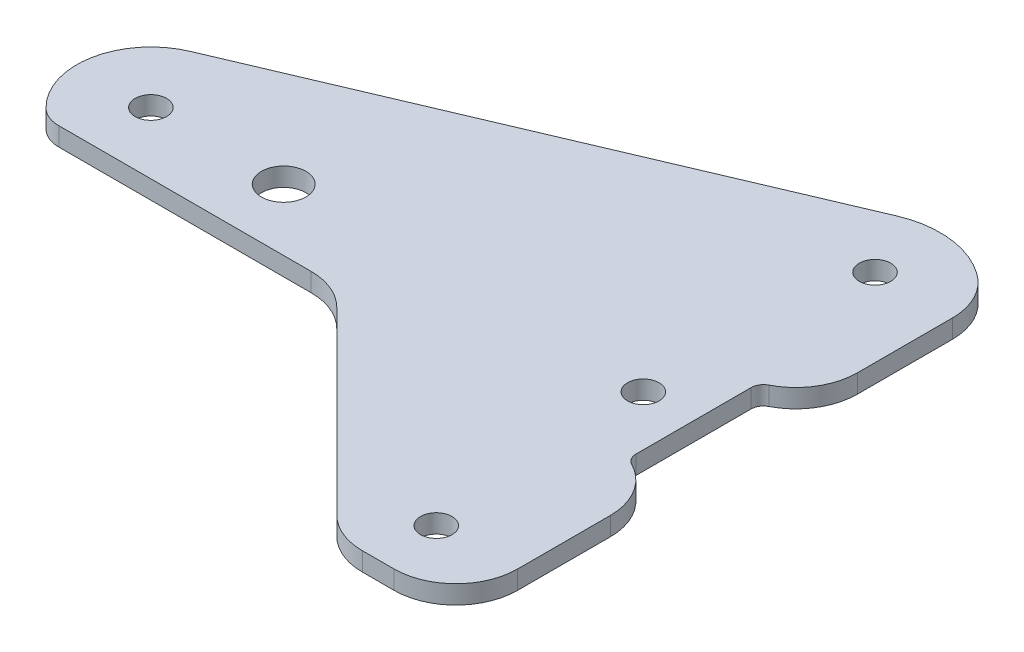
ISO-10303-21;
HEADER;
FILE_DESCRIPTION(('STEP AP214'),'2;1');
FILE_NAME('part.step','',(''),(''),'','','');
FILE_SCHEMA(('AUTOMOTIVE_DESIGN { 1 0 10303 214 1 1 1 1 }'));
ENDSEC;
DATA;
#1=APPLICATION_CONTEXT('core data for automotive mechanical design processes');
#2=APPLICATION_PROTOCOL_DEFINITION('international standard','automotive_design',2000,#1);
#3=PRODUCT_CONTEXT('',#1,'mechanical');
#4=PRODUCT('Part','Part','',(#3));
#5=PRODUCT_RELATED_PRODUCT_CATEGORY('part','',(#4));
#6=PRODUCT_DEFINITION_FORMATION('','',#4);
#7=PRODUCT_DEFINITION_CONTEXT('part definition',#1,'design');
#8=PRODUCT_DEFINITION('design','',#6,#7);
#9=PRODUCT_DEFINITION_SHAPE('','',#8);
#10=(LENGTH_UNIT() NAMED_UNIT(*) SI_UNIT(.MILLI.,.METRE.));
#11=(NAMED_UNIT(*) PLANE_ANGLE_UNIT() SI_UNIT($,.RADIAN.));
#12=(NAMED_UNIT(*) SI_UNIT($,.STERADIAN.) SOLID_ANGLE_UNIT());
#13=UNCERTAINTY_MEASURE_WITH_UNIT(LENGTH_MEASURE(1.E-05),#10,'distance_accuracy_value','');
#14=(GEOMETRIC_REPRESENTATION_CONTEXT(3) GLOBAL_UNCERTAINTY_ASSIGNED_CONTEXT((#13)) GLOBAL_UNIT_ASSIGNED_CONTEXT((#10,
#11,#12)) REPRESENTATION_CONTEXT('',''));
#15=CARTESIAN_POINT('',(0.,0.,0.));
#16=DIRECTION('',(0.,0.,1.));
#17=DIRECTION('',(1.,0.,0.));
#18=AXIS2_PLACEMENT_3D('',#15,#16,#17);
#19=CARTESIAN_POINT('',(243.548253692,70.6652182043,21.06693323164));
#20=DIRECTION('',(0.578405924452189,0.,-0.815749095346485));
#21=DIRECTION('',(-0.815749095346485,0.,-0.578405924452189));
#22=AXIS2_PLACEMENT_3D('',#19,#20,#21);
#23=PLANE('',#22);
#24=DIRECTION('',(0.,1.,0.));
#25=VECTOR('',#24,1.);
#26=CARTESIAN_POINT('',(218.489516869227,70.6652182043,3.29906573380305));
#27=LINE('',#26,#25);
#28=CARTESIAN_POINT('',(218.48951686925,70.6652182043,3.29906573382962));
#29=VERTEX_POINT('',#28);
#30=CARTESIAN_POINT('',(218.489516869488,67.6652182043,3.29906573399572));
#31=VERTEX_POINT('',#30);
#32=EDGE_CURVE('E302',#29,#31,#27,.F.);
#33=ORIENTED_EDGE('',*,*,#32,.F.);
#34=DIRECTION('',(-0.815749095346485,0.,-0.578405924452189));
#35=VECTOR('',#34,1.);
#36=CARTESIAN_POINT('',(243.548253692,70.6652182043,21.06693323164));
#37=LINE('',#36,#35);
#38=CARTESIAN_POINT('',(218.548253692011,70.6652182043,3.34071300805364));
#39=VERTEX_POINT('',#38);
#40=EDGE_CURVE('E197',#29,#39,#37,.F.);
#41=ORIENTED_EDGE('',*,*,#40,.T.);
#42=DIRECTION('',(0.,-1.,0.));
#43=VECTOR('',#42,1.);
#44=CARTESIAN_POINT('',(218.548253692006,70.6652182043,3.3407130080441));
#45=LINE('',#44,#43);
#46=CARTESIAN_POINT('',(218.54825369217,67.6652182043,3.3407130081649));
#47=VERTEX_POINT('',#46);
#48=EDGE_CURVE('E301',#47,#39,#45,.F.);
#49=ORIENTED_EDGE('',*,*,#48,.F.);
#50=DIRECTION('',(0.815749095324096,0.,0.578405924483765));
#51=VECTOR('',#50,1.);
#52=CARTESIAN_POINT('',(218.48951686922,67.6652182043,3.2990657338129));
#53=LINE('',#52,#51);
#54=EDGE_CURVE('E182',#31,#47,#53,.T.);
#55=ORIENTED_EDGE('',*,*,#54,.F.);
#56=EDGE_LOOP('',(#33,#41,#49,#55));
#57=FACE_BOUND('',#56,.T.);
#58=ADVANCED_FACE('F37',(#57),#23,.T.);
#59=CARTESIAN_POINT('',(123.5086322231,67.6652182043,51.87705587159));
#60=DIRECTION('',(0.,-1.,0.));
#61=DIRECTION('',(0.,0.,-1.));
#62=AXIS2_PLACEMENT_3D('',#59,#60,#61);
#63=PLANE('',#62);
#64=CARTESIAN_POINT('',(208.1076117087,67.6652182043,46.87705587159));
#65=DIRECTION('',(0.,1.,0.));
#66=DIRECTION('',(0.,0.,1.));
#67=AXIS2_PLACEMENT_3D('',#64,#65,#66);
#68=CIRCLE('',#67,2.54999999999999);
#69=CARTESIAN_POINT('',(208.1076117087,67.6652182043,49.42705587159));
#70=VERTEX_POINT('',#69);
#71=EDGE_CURVE('E220',#70,#70,#68,.T.);
#72=ORIENTED_EDGE('',*,*,#71,.T.);
#73=EDGE_LOOP('',(#72));
#74=FACE_BOUND('',#73,.T.);
#75=CARTESIAN_POINT('',(210.1,67.6652182043,82.37705587159));
#76=DIRECTION('',(0.,-1.,0.));
#77=DIRECTION('',(0.,0.,-1.));
#78=AXIS2_PLACEMENT_3D('',#75,#76,#77);
#79=CIRCLE('',#78,2.55);
#80=CARTESIAN_POINT('',(210.1,67.6652182043,79.82705587159));
#81=VERTEX_POINT('',#80);
#82=EDGE_CURVE('E274',#81,#81,#79,.F.);
#83=ORIENTED_EDGE('',*,*,#82,.T.);
#84=EDGE_LOOP('',(#83));
#85=FACE_BOUND('',#84,.T.);
#86=CARTESIAN_POINT('',(210.1,67.6652182043,11.37705587159));
#87=DIRECTION('',(0.,-1.,0.));
#88=DIRECTION('',(0.,0.,-1.));
#89=AXIS2_PLACEMENT_3D('',#86,#87,#88);
#90=CIRCLE('',#89,2.55);
#91=CARTESIAN_POINT('',(210.1,67.6652182043,8.82705587159));
#92=VERTEX_POINT('',#91);
#93=EDGE_CURVE('E277',#92,#92,#90,.F.);
#94=ORIENTED_EDGE('',*,*,#93,.T.);
#95=EDGE_LOOP('',(#94));
#96=FACE_BOUND('',#95,.T.);
#97=CARTESIAN_POINT('',(164.3506005389,67.6652182043,66.87705587159));
#98=DIRECTION('',(0.,1.,0.));
#99=DIRECTION('',(0.,0.,1.));
#100=AXIS2_PLACEMENT_3D('',#97,#98,#99);
#101=CIRCLE('',#100,10.);
#102=CARTESIAN_POINT('',(171.421668350768,67.6652182043,59.8059880597423));
#103=VERTEX_POINT('',#102);
#104=CARTESIAN_POINT('',(164.3506005389,67.6652182043,56.87705587159));
#105=VERTEX_POINT('',#104);
#106=EDGE_CURVE('E176',#103,#105,#101,.T.);
#107=ORIENTED_EDGE('',*,*,#106,.T.);
#108=DIRECTION('',(-1.,0.,0.));
#109=VECTOR('',#108,1.);
#110=CARTESIAN_POINT('',(186.,67.6652182043,56.87705587159));
#111=LINE('',#110,#109);
#112=CARTESIAN_POINT('',(123.5086322231,67.6652182043,56.87705587159));
#113=VERTEX_POINT('',#112);
#114=EDGE_CURVE('E170',#105,#113,#111,.T.);
#115=ORIENTED_EDGE('',*,*,#114,.T.);
#116=CARTESIAN_POINT('',(123.5086322231,67.6652182043,51.87705587159));
#117=DIRECTION('',(0.,-1.,0.));
#118=DIRECTION('',(0.,0.,-1.));
#119=AXIS2_PLACEMENT_3D('',#116,#117,#118);
#120=CIRCLE('',#119,5.);
#121=CARTESIAN_POINT('',(120.009361161997,67.6652182043,55.4484844430008));
#122=VERTEX_POINT('',#121);
#123=EDGE_CURVE('E40',#122,#113,#120,.F.);
#124=ORIENTED_EDGE('',*,*,#123,.F.);
#125=CARTESIAN_POINT('',(128.4076117087,67.6652182043,46.87705587159));
#126=DIRECTION('',(0.,1.,0.));
#127=DIRECTION('',(0.,0.,1.));
#128=AXIS2_PLACEMENT_3D('',#125,#126,#127);
#129=CIRCLE('',#128,12.);
#130=CARTESIAN_POINT('',(123.713460139609,67.6652182043,35.8332820126853));
#131=VERTEX_POINT('',#130);
#132=EDGE_CURVE('E165',#131,#122,#129,.T.);
#133=ORIENTED_EDGE('',*,*,#132,.F.);
#134=DIRECTION('',(-0.920314488241643,0.,0.391179297423218));
#135=VECTOR('',#134,1.);
#136=CARTESIAN_POINT('',(203.9457385411,67.6652182043,1.730584840413));
#137=LINE('',#136,#135);
#138=CARTESIAN_POINT('',(203.945738541126,67.6652182043,1.73058484041418));
#139=VERTEX_POINT('',#138);
#140=EDGE_CURVE('E221',#139,#131,#137,.T.);
#141=ORIENTED_EDGE('',*,*,#140,.F.);
#142=CARTESIAN_POINT('',(209.8134280025,67.6652182043,15.53530216404));
#143=DIRECTION('',(0.,1.,0.));
#144=DIRECTION('',(0.,0.,1.));
#145=AXIS2_PLACEMENT_3D('',#142,#143,#144);
#146=CIRCLE('',#145,15.);
#147=EDGE_CURVE('E303',#31,#139,#146,.T.);
#148=ORIENTED_EDGE('',*,*,#147,.F.);
#149=ORIENTED_EDGE('',*,*,#54,.T.);
#150=CARTESIAN_POINT('',(212.7641944475,67.6652182043,11.49820396152));
#151=DIRECTION('',(0.,-1.,0.));
#152=DIRECTION('',(0.,0.,-1.));
#153=AXIS2_PLACEMENT_3D('',#150,#151,#152);
#154=CIRCLE('',#153,10.);
#155=CARTESIAN_POINT('',(222.7641944475,67.6652182043,11.49820396152));
#156=VERTEX_POINT('',#155);
#157=EDGE_CURVE('E298',#156,#47,#154,.F.);
#158=ORIENTED_EDGE('',*,*,#157,.F.);
#159=DIRECTION('',(0.,0.,-1.));
#160=VECTOR('',#159,1.);
#161=CARTESIAN_POINT('',(222.7641944475,67.6652182043,46.01057575408));
#162=LINE('',#161,#160);
#163=CARTESIAN_POINT('',(222.7641944475,67.6652182043,26.87705587159));
#164=VERTEX_POINT('',#163);
#165=EDGE_CURVE('E214',#164,#156,#162,.T.);
#166=ORIENTED_EDGE('',*,*,#165,.F.);
#167=CARTESIAN_POINT('',(212.7641944475,67.6652182043,26.87705587159));
#168=DIRECTION('',(0.,1.,0.));
#169=DIRECTION('',(0.,0.,1.));
#170=AXIS2_PLACEMENT_3D('',#167,#168,#169);
#171=CIRCLE('',#170,10.);
#172=CARTESIAN_POINT('',(217.323870368322,67.6652182043,35.7770196634822));
#173=VERTEX_POINT('',#172);
#174=EDGE_CURVE('E217',#173,#164,#171,.T.);
#175=ORIENTED_EDGE('',*,*,#174,.F.);
#176=CARTESIAN_POINT('',(218.2358055525,67.6652182043,37.55701242185));
#177=DIRECTION('',(0.,1.,0.));
#178=DIRECTION('',(0.,0.,1.));
#179=AXIS2_PLACEMENT_3D('',#176,#177,#178);
#180=CIRCLE('',#179,2.);
#181=CARTESIAN_POINT('',(216.2358055525,67.6652182043,37.55701242185));
#182=VERTEX_POINT('',#181);
#183=EDGE_CURVE('E213',#173,#182,#180,.T.);
#184=ORIENTED_EDGE('',*,*,#183,.T.);
#185=DIRECTION('',(0.,0.,-1.));
#186=VECTOR('',#185,1.);
#187=CARTESIAN_POINT('',(216.2358055525,67.6652182043,57.49900083147));
#188=LINE('',#187,#186);
#189=CARTESIAN_POINT('',(216.2358055525,67.6652182043,56.19709932133));
#190=VERTEX_POINT('',#189);
#191=EDGE_CURVE('E210',#190,#182,#188,.T.);
#192=ORIENTED_EDGE('',*,*,#191,.F.);
#193=CARTESIAN_POINT('',(218.2358055525,67.6652182043,56.19709932133));
#194=DIRECTION('',(0.,-1.,0.));
#195=DIRECTION('',(0.,0.,-1.));
#196=AXIS2_PLACEMENT_3D('',#193,#194,#195);
#197=CIRCLE('',#196,2.);
#198=CARTESIAN_POINT('',(217.323870368324,67.6652182043,57.9770920796941));
#199=VERTEX_POINT('',#198);
#200=EDGE_CURVE('E289',#190,#199,#197,.F.);
#201=ORIENTED_EDGE('',*,*,#200,.T.);
#202=CARTESIAN_POINT('',(212.7641944475,67.6652182043,66.87705587159));
#203=DIRECTION('',(0.,-1.,0.));
#204=DIRECTION('',(0.,0.,-1.));
#205=AXIS2_PLACEMENT_3D('',#202,#203,#204);
#206=CIRCLE('',#205,9.99999999999999);
#207=CARTESIAN_POINT('',(222.7641944475,67.6652182043,66.87705587159));
#208=VERTEX_POINT('',#207);
#209=EDGE_CURVE('E287',#208,#199,#206,.F.);
#210=ORIENTED_EDGE('',*,*,#209,.F.);
#211=DIRECTION('',(0.,0.,-1.));
#212=VECTOR('',#211,1.);
#213=CARTESIAN_POINT('',(222.7641944475,67.6652182043,46.01057575408));
#214=LINE('',#213,#212);
#215=CARTESIAN_POINT('',(222.7641944475,67.6652182043,81.87705587159));
#216=VERTEX_POINT('',#215);
#217=EDGE_CURVE('E206',#216,#208,#214,.T.);
#218=ORIENTED_EDGE('',*,*,#217,.F.);
#219=CARTESIAN_POINT('',(212.7641944475,67.6652182043,81.87705587159));
#220=DIRECTION('',(0.,1.,0.));
#221=DIRECTION('',(0.,0.,1.));
#222=AXIS2_PLACEMENT_3D('',#219,#220,#221);
#223=CIRCLE('',#222,9.99999999999999);
#224=CARTESIAN_POINT('',(212.7641944475,67.6652182043,91.87705587159));
#225=VERTEX_POINT('',#224);
#226=EDGE_CURVE('E205',#225,#216,#223,.T.);
#227=ORIENTED_EDGE('',*,*,#226,.F.);
#228=DIRECTION('',(1.,0.,0.));
#229=VECTOR('',#228,1.);
#230=CARTESIAN_POINT('',(167.5857864376,67.6652182043,91.87705587159));
#231=LINE('',#230,#229);
#232=CARTESIAN_POINT('',(207.6348717864,67.6652182043,91.87705587159));
#233=VERTEX_POINT('',#232);
#234=EDGE_CURVE('E202',#233,#225,#231,.T.);
#235=ORIENTED_EDGE('',*,*,#234,.F.);
#236=CARTESIAN_POINT('',(207.6348717864,67.6652182043,81.87705587159));
#237=DIRECTION('',(0.,-1.,0.));
#238=DIRECTION('',(0.,0.,-1.));
#239=AXIS2_PLACEMENT_3D('',#236,#237,#238);
#240=CIRCLE('',#239,10.);
#241=CARTESIAN_POINT('',(200.563803974493,67.6652182043,88.9481236834825));
#242=VERTEX_POINT('',#241);
#243=EDGE_CURVE('E282',#242,#233,#240,.F.);
#244=ORIENTED_EDGE('',*,*,#243,.F.);
#245=DIRECTION('',(0.707106781186548,0.,0.707106781186548));
#246=VECTOR('',#245,1.);
#247=CARTESIAN_POINT('',(168.4927361626,67.6652182043,56.87705587159));
#248=LINE('',#247,#246);
#249=EDGE_CURVE('E198',#103,#242,#248,.T.);
#250=ORIENTED_EDGE('',*,*,#249,.F.);
#251=EDGE_LOOP('',(#107,#115,#124,#133,#141,#148,#149,#158,#166,#175,#184,#192,#201,#210,#218,
#227,#235,#244,#250));
#252=FACE_BOUND('',#251,.T.);
#253=CARTESIAN_POINT('',(149.9,67.6652182043,46.87705587159));
#254=DIRECTION('',(0.,-1.,0.));
#255=DIRECTION('',(0.,0.,-1.));
#256=AXIS2_PLACEMENT_3D('',#253,#254,#255);
#257=CIRCLE('',#256,3.59999999999999);
#258=CARTESIAN_POINT('',(149.9,67.6652182043,43.27705587159));
#259=VERTEX_POINT('',#258);
#260=EDGE_CURVE('E268',#259,#259,#257,.F.);
#261=ORIENTED_EDGE('',*,*,#260,.T.);
#262=EDGE_LOOP('',(#261));
#263=FACE_BOUND('',#262,.T.);
#264=CARTESIAN_POINT('',(128.4076117087,67.6652182043,46.87705587159));
#265=DIRECTION('',(0.,1.,0.));
#266=DIRECTION('',(0.,0.,1.));
#267=AXIS2_PLACEMENT_3D('',#264,#265,#266);
#268=CIRCLE('',#267,2.55);
#269=CARTESIAN_POINT('',(128.4076117087,67.6652182043,49.42705587159));
#270=VERTEX_POINT('',#269);
#271=EDGE_CURVE('E271',#270,#270,#268,.T.);
#272=ORIENTED_EDGE('',*,*,#271,.T.);
#273=EDGE_LOOP('',(#272));
#274=FACE_BOUND('',#273,.T.);
#275=ADVANCED_FACE('F172',(#74,#85,#96,#252,#263,#274),#63,.T.);
#276=CARTESIAN_POINT('',(186.,67.6652182043,56.87705587159));
#277=DIRECTION('',(0.,0.,-1.));
#278=DIRECTION('',(-1.,0.,0.));
#279=AXIS2_PLACEMENT_3D('',#276,#277,#278);
#280=PLANE('',#279);
#281=DIRECTION('',(1.,0.,0.));
#282=VECTOR('',#281,1.);
#283=CARTESIAN_POINT('',(225.5,70.6652182043,56.87705587159));
#284=LINE('',#283,#282);
#285=CARTESIAN_POINT('',(164.3506005389,70.6652182043,56.87705587159));
#286=VERTEX_POINT('',#285);
#287=CARTESIAN_POINT('',(123.5086322231,70.6652182043,56.87705587159));
#288=VERTEX_POINT('',#287);
#289=EDGE_CURVE('E191',#286,#288,#284,.F.);
#290=ORIENTED_EDGE('',*,*,#289,.T.);
#291=DIRECTION('',(0.,-1.,0.));
#292=VECTOR('',#291,1.);
#293=CARTESIAN_POINT('',(123.5086322231,76.9302182043,56.87705587159));
#294=LINE('',#293,#292);
#295=EDGE_CURVE('E181',#113,#288,#294,.F.);
#296=ORIENTED_EDGE('',*,*,#295,.F.);
#297=ORIENTED_EDGE('',*,*,#114,.F.);
#298=DIRECTION('',(0.,1.,0.));
#299=VECTOR('',#298,1.);
#300=CARTESIAN_POINT('',(164.3506005389,67.6652182043,56.87705587159));
#301=LINE('',#300,#299);
#302=EDGE_CURVE('E281',#105,#286,#301,.T.);
#303=ORIENTED_EDGE('',*,*,#302,.T.);
#304=EDGE_LOOP('',(#290,#296,#297,#303));
#305=FACE_BOUND('',#304,.T.);
#306=ADVANCED_FACE('F190',(#305),#280,.F.);
#307=CARTESIAN_POINT('',(123.5086322231,76.9302182043,51.87705587159));
#308=DIRECTION('',(0.,-1.,0.));
#309=DIRECTION('',(0.,0.,-1.));
#310=AXIS2_PLACEMENT_3D('',#307,#308,#309);
#311=CYLINDRICAL_SURFACE('',#310,5.);
#312=DIRECTION('',(0.,1.,0.));
#313=VECTOR('',#312,1.);
#314=CARTESIAN_POINT('',(120.009361162008,70.6652182043,55.4484844430119));
#315=LINE('',#314,#313);
#316=CARTESIAN_POINT('',(120.009361161997,70.6652182043,55.4484844430008));
#317=VERTEX_POINT('',#316);
#318=EDGE_CURVE('E188',#122,#317,#315,.T.);
#319=ORIENTED_EDGE('',*,*,#318,.F.);
#320=ORIENTED_EDGE('',*,*,#123,.T.);
#321=ORIENTED_EDGE('',*,*,#295,.T.);
#322=CARTESIAN_POINT('',(123.5086322231,70.6652182043,51.87705587159));
#323=DIRECTION('',(0.,-1.,0.));
#324=DIRECTION('',(0.,0.,-1.));
#325=AXIS2_PLACEMENT_3D('',#322,#323,#324);
#326=CIRCLE('',#325,5.);
#327=EDGE_CURVE('E266',#288,#317,#326,.T.);
#328=ORIENTED_EDGE('',*,*,#327,.T.);
#329=EDGE_LOOP('',(#319,#320,#321,#328));
#330=FACE_BOUND('',#329,.T.);
#331=ADVANCED_FACE('F185',(#330),#311,.T.);
#332=CARTESIAN_POINT('',(128.4076117087,70.6652182043,46.87705587159));
#333=DIRECTION('',(0.,1.,0.));
#334=DIRECTION('',(0.,0.,1.));
#335=AXIS2_PLACEMENT_3D('',#332,#333,#334);
#336=CYLINDRICAL_SURFACE('',#335,12.);
#337=ORIENTED_EDGE('',*,*,#132,.T.);
#338=ORIENTED_EDGE('',*,*,#318,.T.);
#339=CARTESIAN_POINT('',(128.4076117087,70.6652182043,46.87705587159));
#340=DIRECTION('',(0.,1.,0.));
#341=DIRECTION('',(0.,0.,1.));
#342=AXIS2_PLACEMENT_3D('',#339,#340,#341);
#343=CIRCLE('',#342,12.);
#344=CARTESIAN_POINT('',(123.713460139609,70.6652182043,35.8332820126857));
#345=VERTEX_POINT('',#344);
#346=EDGE_CURVE('E263',#317,#345,#343,.F.);
#347=ORIENTED_EDGE('',*,*,#346,.T.);
#348=DIRECTION('',(0.,1.,0.));
#349=VECTOR('',#348,1.);
#350=CARTESIAN_POINT('',(123.7134601396,70.6652182043,35.8332820126891));
#351=LINE('',#350,#349);
#352=EDGE_CURVE('E222',#131,#345,#351,.T.);
#353=ORIENTED_EDGE('',*,*,#352,.F.);
#354=EDGE_LOOP('',(#337,#338,#347,#353));
#355=FACE_BOUND('',#354,.T.);
#356=ADVANCED_FACE('F306',(#355),#336,.T.);
#357=CARTESIAN_POINT('',(203.9457385411,70.6652182043,1.730584840413));
#358=DIRECTION('',(-0.391179297423218,0.,-0.920314488241643));
#359=DIRECTION('',(-0.920314488241643,0.,0.391179297423218));
#360=AXIS2_PLACEMENT_3D('',#357,#358,#359);
#361=PLANE('',#360);
#362=ORIENTED_EDGE('',*,*,#352,.T.);
#363=DIRECTION('',(0.920314488241638,0.,-0.391179297423229));
#364=VECTOR('',#363,1.);
#365=CARTESIAN_POINT('',(123.7134601396,70.6652182043,35.83328201269));
#366=LINE('',#365,#364);
#367=CARTESIAN_POINT('',(203.945738541126,70.6652182043,1.73058484041421));
#368=VERTEX_POINT('',#367);
#369=EDGE_CURVE('E262',#345,#368,#366,.T.);
#370=ORIENTED_EDGE('',*,*,#369,.T.);
#371=DIRECTION('',(0.,1.,0.));
#372=VECTOR('',#371,1.);
#373=CARTESIAN_POINT('',(203.945738541109,70.6652182043,1.7305848404336));
#374=LINE('',#373,#372);
#375=EDGE_CURVE('E304',#139,#368,#374,.T.);
#376=ORIENTED_EDGE('',*,*,#375,.F.);
#377=ORIENTED_EDGE('',*,*,#140,.T.);
#378=EDGE_LOOP('',(#362,#370,#376,#377));
#379=FACE_BOUND('',#378,.T.);
#380=ADVANCED_FACE('F340',(#379),#361,.T.);
#381=CARTESIAN_POINT('',(209.8134280025,70.6652182043,15.53530216404));
#382=DIRECTION('',(0.,1.,0.));
#383=DIRECTION('',(0.,0.,1.));
#384=AXIS2_PLACEMENT_3D('',#381,#382,#383);
#385=CYLINDRICAL_SURFACE('',#384,15.);
#386=CARTESIAN_POINT('',(209.8134280025,70.6652182043,15.53530216404));
#387=DIRECTION('',(0.,1.,0.));
#388=DIRECTION('',(0.,0.,1.));
#389=AXIS2_PLACEMENT_3D('',#386,#387,#388);
#390=CIRCLE('',#389,15.);
#391=EDGE_CURVE('E260',#368,#29,#390,.F.);
#392=ORIENTED_EDGE('',*,*,#391,.T.);
#393=ORIENTED_EDGE('',*,*,#32,.T.);
#394=ORIENTED_EDGE('',*,*,#147,.T.);
#395=ORIENTED_EDGE('',*,*,#375,.T.);
#396=EDGE_LOOP('',(#392,#393,#394,#395));
#397=FACE_BOUND('',#396,.T.);
#398=ADVANCED_FACE('F344',(#397),#385,.T.);
#399=CARTESIAN_POINT('',(212.7641944475,70.6652182043,11.49820396152));
#400=DIRECTION('',(0.,-1.,0.));
#401=DIRECTION('',(0.,0.,-1.));
#402=AXIS2_PLACEMENT_3D('',#399,#400,#401);
#403=CYLINDRICAL_SURFACE('',#402,10.);
#404=ORIENTED_EDGE('',*,*,#48,.T.);
#405=CARTESIAN_POINT('',(212.7641944475,70.6652182043,11.49820396152));
#406=DIRECTION('',(0.,-1.,0.));
#407=DIRECTION('',(0.,0.,-1.));
#408=AXIS2_PLACEMENT_3D('',#405,#406,#407);
#409=CIRCLE('',#408,10.);
#410=CARTESIAN_POINT('',(222.7641944475,70.6652182043,11.49820396152));
#411=VERTEX_POINT('',#410);
#412=EDGE_CURVE('E257',#39,#411,#409,.T.);
#413=ORIENTED_EDGE('',*,*,#412,.T.);
#414=DIRECTION('',(0.,1.,0.));
#415=VECTOR('',#414,1.);
#416=CARTESIAN_POINT('',(222.7641944475,69.4152182043,11.49820396152));
#417=LINE('',#416,#415);
#418=EDGE_CURVE('E218',#156,#411,#417,.T.);
#419=ORIENTED_EDGE('',*,*,#418,.F.);
#420=ORIENTED_EDGE('',*,*,#157,.T.);
#421=EDGE_LOOP('',(#404,#413,#419,#420));
#422=FACE_BOUND('',#421,.T.);
#423=ADVANCED_FACE('F350',(#422),#403,.T.);
#424=CARTESIAN_POINT('',(222.7641944475,69.4152182043,46.01057575408));
#425=DIRECTION('',(1.,0.,0.));
#426=DIRECTION('',(0.,0.,-1.));
#427=AXIS2_PLACEMENT_3D('',#424,#425,#426);
#428=PLANE('',#427);
#429=DIRECTION('',(0.,1.,0.));
#430=VECTOR('',#429,1.);
#431=CARTESIAN_POINT('',(222.7641944475,69.4152182043,26.87705587159));
#432=LINE('',#431,#430);
#433=CARTESIAN_POINT('',(222.7641944475,70.6652182043,26.87705587159));
#434=VERTEX_POINT('',#433);
#435=EDGE_CURVE('E297',#164,#434,#432,.T.);
#436=ORIENTED_EDGE('',*,*,#435,.F.);
#437=ORIENTED_EDGE('',*,*,#165,.T.);
#438=ORIENTED_EDGE('',*,*,#418,.T.);
#439=DIRECTION('',(0.,0.,-1.));
#440=VECTOR('',#439,1.);
#441=CARTESIAN_POINT('',(222.7641944475,70.6652182043,46.87705587159));
#442=LINE('',#441,#440);
#443=EDGE_CURVE('E256',#411,#434,#442,.F.);
#444=ORIENTED_EDGE('',*,*,#443,.T.);
#445=EDGE_LOOP('',(#436,#437,#438,#444));
#446=FACE_BOUND('',#445,.T.);
#447=ADVANCED_FACE('F358',(#446),#428,.T.);
#448=CARTESIAN_POINT('',(212.7641944475,69.4152182043,26.87705587159));
#449=DIRECTION('',(0.,1.,0.));
#450=DIRECTION('',(0.,0.,1.));
#451=AXIS2_PLACEMENT_3D('',#448,#449,#450);
#452=CYLINDRICAL_SURFACE('',#451,10.);
#453=ORIENTED_EDGE('',*,*,#435,.T.);
#454=CARTESIAN_POINT('',(212.7641944475,70.6652182043,26.87705587159));
#455=DIRECTION('',(0.,1.,0.));
#456=DIRECTION('',(0.,0.,1.));
#457=AXIS2_PLACEMENT_3D('',#454,#455,#456);
#458=CIRCLE('',#457,10.);
#459=CARTESIAN_POINT('',(217.32387036832,70.6652182043,35.7770196634785));
#460=VERTEX_POINT('',#459);
#461=EDGE_CURVE('E253',#434,#460,#458,.F.);
#462=ORIENTED_EDGE('',*,*,#461,.T.);
#463=DIRECTION('',(0.,1.,0.));
#464=VECTOR('',#463,1.);
#465=CARTESIAN_POINT('',(217.323870368308,64.9062182043,35.7770196634849));
#466=LINE('',#465,#464);
#467=EDGE_CURVE('E295',#460,#173,#466,.F.);
#468=ORIENTED_EDGE('',*,*,#467,.T.);
#469=ORIENTED_EDGE('',*,*,#174,.T.);
#470=EDGE_LOOP('',(#453,#462,#468,#469));
#471=FACE_BOUND('',#470,.T.);
#472=ADVANCED_FACE('F365',(#471),#452,.T.);
#473=CARTESIAN_POINT('',(218.2358055525,64.9062182043,37.55701242185));
#474=DIRECTION('',(0.,1.,0.));
#475=DIRECTION('',(0.,0.,1.));
#476=AXIS2_PLACEMENT_3D('',#473,#474,#475);
#477=CYLINDRICAL_SURFACE('',#476,2.);
#478=DIRECTION('',(0.,1.,0.));
#479=VECTOR('',#478,1.);
#480=CARTESIAN_POINT('',(216.2358055525,70.6652182043,37.55701242185));
#481=LINE('',#480,#479);
#482=CARTESIAN_POINT('',(216.2358055525,70.6652182043,37.55701242185));
#483=VERTEX_POINT('',#482);
#484=EDGE_CURVE('E212',#182,#483,#481,.T.);
#485=ORIENTED_EDGE('',*,*,#484,.F.);
#486=ORIENTED_EDGE('',*,*,#183,.F.);
#487=ORIENTED_EDGE('',*,*,#467,.F.);
#488=CARTESIAN_POINT('',(218.2358055525,70.6652182043,37.55701242185));
#489=DIRECTION('',(0.,1.,0.));
#490=DIRECTION('',(0.,0.,1.));
#491=AXIS2_PLACEMENT_3D('',#488,#489,#490);
#492=CIRCLE('',#491,2.);
#493=EDGE_CURVE('E250',#460,#483,#492,.T.);
#494=ORIENTED_EDGE('',*,*,#493,.T.);
#495=EDGE_LOOP('',(#485,#486,#487,#494));
#496=FACE_BOUND('',#495,.T.);
#497=ADVANCED_FACE('F364',(#496),#477,.F.);
#498=CARTESIAN_POINT('',(216.2358055525,70.6652182043,57.49900083147));
#499=DIRECTION('',(1.,0.,0.));
#500=DIRECTION('',(0.,0.,-1.));
#501=AXIS2_PLACEMENT_3D('',#498,#499,#500);
#502=PLANE('',#501);
#503=ORIENTED_EDGE('',*,*,#484,.T.);
#504=DIRECTION('',(0.,0.,-1.));
#505=VECTOR('',#504,1.);
#506=CARTESIAN_POINT('',(216.2358055525,70.6652182043,46.87705587159));
#507=LINE('',#506,#505);
#508=CARTESIAN_POINT('',(216.2358055525,70.6652182043,56.19709932133));
#509=VERTEX_POINT('',#508);
#510=EDGE_CURVE('E249',#483,#509,#507,.F.);
#511=ORIENTED_EDGE('',*,*,#510,.T.);
#512=DIRECTION('',(0.,-1.,0.));
#513=VECTOR('',#512,1.);
#514=CARTESIAN_POINT('',(216.2358055525,73.9242182043,56.19709932133));
#515=LINE('',#514,#513);
#516=EDGE_CURVE('E292',#509,#190,#515,.T.);
#517=ORIENTED_EDGE('',*,*,#516,.T.);
#518=ORIENTED_EDGE('',*,*,#191,.T.);
#519=EDGE_LOOP('',(#503,#511,#517,#518));
#520=FACE_BOUND('',#519,.T.);
#521=ADVANCED_FACE('F372',(#520),#502,.T.);
#522=CARTESIAN_POINT('',(218.2358055525,73.9242182043,56.19709932133));
#523=DIRECTION('',(0.,-1.,0.));
#524=DIRECTION('',(0.,0.,-1.));
#525=AXIS2_PLACEMENT_3D('',#522,#523,#524);
#526=CYLINDRICAL_SURFACE('',#525,2.);
#527=ORIENTED_EDGE('',*,*,#200,.F.);
#528=ORIENTED_EDGE('',*,*,#516,.F.);
#529=CARTESIAN_POINT('',(218.2358055525,70.6652182043,56.19709932133));
#530=DIRECTION('',(0.,-1.,0.));
#531=DIRECTION('',(0.,0.,-1.));
#532=AXIS2_PLACEMENT_3D('',#529,#530,#531);
#533=CIRCLE('',#532,2.);
#534=CARTESIAN_POINT('',(217.323870368324,70.6652182043,57.9770920796941));
#535=VERTEX_POINT('',#534);
#536=EDGE_CURVE('E246',#509,#535,#533,.F.);
#537=ORIENTED_EDGE('',*,*,#536,.T.);
#538=DIRECTION('',(0.,-1.,0.));
#539=VECTOR('',#538,1.);
#540=CARTESIAN_POINT('',(217.323870368311,69.4152182043,57.9770920796877));
#541=LINE('',#540,#539);
#542=EDGE_CURVE('E209',#199,#535,#541,.F.);
#543=ORIENTED_EDGE('',*,*,#542,.F.);
#544=EDGE_LOOP('',(#527,#528,#537,#543));
#545=FACE_BOUND('',#544,.T.);
#546=ADVANCED_FACE('F431',(#545),#526,.F.);
#547=CARTESIAN_POINT('',(212.7641944475,69.4152182043,66.87705587159));
#548=DIRECTION('',(0.,-1.,0.));
#549=DIRECTION('',(0.,0.,-1.));
#550=AXIS2_PLACEMENT_3D('',#547,#548,#549);
#551=CYLINDRICAL_SURFACE('',#550,9.99999999999999);
#552=ORIENTED_EDGE('',*,*,#209,.T.);
#553=ORIENTED_EDGE('',*,*,#542,.T.);
#554=CARTESIAN_POINT('',(212.7641944475,70.6652182043,66.87705587159));
#555=DIRECTION('',(0.,-1.,0.));
#556=DIRECTION('',(0.,0.,-1.));
#557=AXIS2_PLACEMENT_3D('',#554,#555,#556);
#558=CIRCLE('',#557,9.99999999999999);
#559=CARTESIAN_POINT('',(222.7641944475,70.6652182043,66.87705587159));
#560=VERTEX_POINT('',#559);
#561=EDGE_CURVE('E243',#535,#560,#558,.T.);
#562=ORIENTED_EDGE('',*,*,#561,.T.);
#563=DIRECTION('',(0.,1.,0.));
#564=VECTOR('',#563,1.);
#565=CARTESIAN_POINT('',(222.7641944475,69.4152182043,66.87705587159));
#566=LINE('',#565,#564);
#567=EDGE_CURVE('E208',#208,#560,#566,.T.);
#568=ORIENTED_EDGE('',*,*,#567,.F.);
#569=EDGE_LOOP('',(#552,#553,#562,#568));
#570=FACE_BOUND('',#569,.T.);
#571=ADVANCED_FACE('F427',(#570),#551,.T.);
#572=CARTESIAN_POINT('',(222.7641944475,69.4152182043,46.01057575408));
#573=DIRECTION('',(1.,0.,0.));
#574=DIRECTION('',(0.,0.,-1.));
#575=AXIS2_PLACEMENT_3D('',#572,#573,#574);
#576=PLANE('',#575);
#577=ORIENTED_EDGE('',*,*,#567,.T.);
#578=DIRECTION('',(0.,0.,-1.));
#579=VECTOR('',#578,1.);
#580=CARTESIAN_POINT('',(222.7641944475,70.6652182043,46.87705587159));
#581=LINE('',#580,#579);
#582=CARTESIAN_POINT('',(222.7641944475,70.6652182043,81.87705587159));
#583=VERTEX_POINT('',#582);
#584=EDGE_CURVE('E242',#560,#583,#581,.F.);
#585=ORIENTED_EDGE('',*,*,#584,.T.);
#586=DIRECTION('',(0.,1.,0.));
#587=VECTOR('',#586,1.);
#588=CARTESIAN_POINT('',(222.7641944475,69.4152182043,81.87705587159));
#589=LINE('',#588,#587);
#590=EDGE_CURVE('E286',#216,#583,#589,.T.);
#591=ORIENTED_EDGE('',*,*,#590,.F.);
#592=ORIENTED_EDGE('',*,*,#217,.T.);
#593=EDGE_LOOP('',(#577,#585,#591,#592));
#594=FACE_BOUND('',#593,.T.);
#595=ADVANCED_FACE('F423',(#594),#576,.T.);
#596=CARTESIAN_POINT('',(212.7641944475,69.4152182043,81.87705587159));
#597=DIRECTION('',(0.,1.,0.));
#598=DIRECTION('',(0.,0.,1.));
#599=AXIS2_PLACEMENT_3D('',#596,#597,#598);
#600=CYLINDRICAL_SURFACE('',#599,9.99999999999999);
#601=DIRECTION('',(0.,1.,0.));
#602=VECTOR('',#601,1.);
#603=CARTESIAN_POINT('',(212.7641944475,69.4152182043,91.87705587159));
#604=LINE('',#603,#602);
#605=CARTESIAN_POINT('',(212.7641944475,70.6652182043,91.87705587159));
#606=VERTEX_POINT('',#605);
#607=EDGE_CURVE('E204',#225,#606,#604,.T.);
#608=ORIENTED_EDGE('',*,*,#607,.F.);
#609=ORIENTED_EDGE('',*,*,#226,.T.);
#610=ORIENTED_EDGE('',*,*,#590,.T.);
#611=CARTESIAN_POINT('',(212.7641944475,70.6652182043,81.87705587159));
#612=DIRECTION('',(0.,1.,0.));
#613=DIRECTION('',(0.,0.,1.));
#614=AXIS2_PLACEMENT_3D('',#611,#612,#613);
#615=CIRCLE('',#614,9.99999999999999);
#616=EDGE_CURVE('E239',#583,#606,#615,.F.);
#617=ORIENTED_EDGE('',*,*,#616,.T.);
#618=EDGE_LOOP('',(#608,#609,#610,#617));
#619=FACE_BOUND('',#618,.T.);
#620=ADVANCED_FACE('F419',(#619),#600,.T.);
#621=CARTESIAN_POINT('',(167.5857864376,69.4152182043,91.87705587159));
#622=DIRECTION('',(0.,0.,1.));
#623=DIRECTION('',(1.,0.,0.));
#624=AXIS2_PLACEMENT_3D('',#621,#622,#623);
#625=PLANE('',#624);
#626=ORIENTED_EDGE('',*,*,#607,.T.);
#627=DIRECTION('',(1.,0.,0.));
#628=VECTOR('',#627,1.);
#629=CARTESIAN_POINT('',(225.5,70.6652182043,91.87705587159));
#630=LINE('',#629,#628);
#631=CARTESIAN_POINT('',(207.6348717864,70.6652182043,91.87705587159));
#632=VERTEX_POINT('',#631);
#633=EDGE_CURVE('E238',#606,#632,#630,.F.);
#634=ORIENTED_EDGE('',*,*,#633,.T.);
#635=DIRECTION('',(0.,-1.,0.));
#636=VECTOR('',#635,1.);
#637=CARTESIAN_POINT('',(207.6348717864,69.4152182043,91.87705587159));
#638=LINE('',#637,#636);
#639=EDGE_CURVE('E200',#233,#632,#638,.F.);
#640=ORIENTED_EDGE('',*,*,#639,.F.);
#641=ORIENTED_EDGE('',*,*,#234,.T.);
#642=EDGE_LOOP('',(#626,#634,#640,#641));
#643=FACE_BOUND('',#642,.T.);
#644=ADVANCED_FACE('F415',(#643),#625,.T.);
#645=CARTESIAN_POINT('',(207.6348717864,69.4152182043,81.87705587159));
#646=DIRECTION('',(0.,-1.,0.));
#647=DIRECTION('',(0.,0.,-1.));
#648=AXIS2_PLACEMENT_3D('',#645,#646,#647);
#649=CYLINDRICAL_SURFACE('',#648,10.);
#650=ORIENTED_EDGE('',*,*,#639,.T.);
#651=CARTESIAN_POINT('',(207.6348717864,70.6652182043,81.87705587159));
#652=DIRECTION('',(0.,-1.,0.));
#653=DIRECTION('',(0.,0.,-1.));
#654=AXIS2_PLACEMENT_3D('',#651,#652,#653);
#655=CIRCLE('',#654,10.);
#656=CARTESIAN_POINT('',(200.563803974498,70.6652182043,88.9481236834732));
#657=VERTEX_POINT('',#656);
#658=EDGE_CURVE('E235',#632,#657,#655,.T.);
#659=ORIENTED_EDGE('',*,*,#658,.T.);
#660=DIRECTION('',(0.,1.,0.));
#661=VECTOR('',#660,1.);
#662=CARTESIAN_POINT('',(200.563803974485,67.6652182043,88.948123683475));
#663=LINE('',#662,#661);
#664=EDGE_CURVE('E199',#242,#657,#663,.T.);
#665=ORIENTED_EDGE('',*,*,#664,.F.);
#666=ORIENTED_EDGE('',*,*,#243,.T.);
#667=EDGE_LOOP('',(#650,#659,#665,#666));
#668=FACE_BOUND('',#667,.T.);
#669=ADVANCED_FACE('F411',(#668),#649,.T.);
#670=CARTESIAN_POINT('',(168.4927361626,67.6652182043,56.87705587159));
#671=DIRECTION('',(-0.707106781186548,0.,0.707106781186548));
#672=DIRECTION('',(0.707106781186548,0.,0.707106781186548));
#673=AXIS2_PLACEMENT_3D('',#670,#671,#672);
#674=PLANE('',#673);
#675=ORIENTED_EDGE('',*,*,#664,.T.);
#676=DIRECTION('',(-0.707106781186183,0.,-0.707106781186912));
#677=VECTOR('',#676,1.);
#678=CARTESIAN_POINT('',(200.5638039745,70.6652182043,88.94812368346));
#679=LINE('',#678,#677);
#680=CARTESIAN_POINT('',(171.421668350785,70.6652182043,59.8059880597291));
#681=VERTEX_POINT('',#680);
#682=EDGE_CURVE('E234',#657,#681,#679,.T.);
#683=ORIENTED_EDGE('',*,*,#682,.T.);
#684=DIRECTION('',(0.,1.,0.));
#685=VECTOR('',#684,1.);
#686=CARTESIAN_POINT('',(171.421668350785,67.6652182043,59.8059880597445));
#687=LINE('',#686,#685);
#688=EDGE_CURVE('E55',#681,#103,#687,.F.);
#689=ORIENTED_EDGE('',*,*,#688,.T.);
#690=ORIENTED_EDGE('',*,*,#249,.T.);
#691=EDGE_LOOP('',(#675,#683,#689,#690));
#692=FACE_BOUND('',#691,.T.);
#693=ADVANCED_FACE('F408',(#692),#674,.T.);
#694=CARTESIAN_POINT('',(164.3506005389,67.6652182043,66.87705587159));
#695=DIRECTION('',(0.,1.,0.));
#696=DIRECTION('',(0.,0.,1.));
#697=AXIS2_PLACEMENT_3D('',#694,#695,#696);
#698=CYLINDRICAL_SURFACE('',#697,10.);
#699=CARTESIAN_POINT('',(164.3506005389,70.6652182043,66.87705587159));
#700=DIRECTION('',(0.,1.,0.));
#701=DIRECTION('',(0.,0.,1.));
#702=AXIS2_PLACEMENT_3D('',#699,#700,#701);
#703=CIRCLE('',#702,10.);
#704=EDGE_CURVE('E232',#681,#286,#703,.T.);
#705=ORIENTED_EDGE('',*,*,#704,.T.);
#706=ORIENTED_EDGE('',*,*,#302,.F.);
#707=ORIENTED_EDGE('',*,*,#106,.F.);
#708=ORIENTED_EDGE('',*,*,#688,.F.);
#709=EDGE_LOOP('',(#705,#706,#707,#708));
#710=FACE_BOUND('',#709,.T.);
#711=ADVANCED_FACE('F404',(#710),#698,.F.);
#712=CARTESIAN_POINT('',(210.1,70.6652182043,11.37705587159));
#713=DIRECTION('',(0.,-1.,0.));
#714=DIRECTION('',(0.,0.,-1.));
#715=AXIS2_PLACEMENT_3D('',#712,#713,#714);
#716=CYLINDRICAL_SURFACE('',#715,2.55);
#717=CARTESIAN_POINT('',(210.1,70.6652182043,11.37705587159));
#718=DIRECTION('',(0.,-1.,0.));
#719=DIRECTION('',(0.,0.,-1.));
#720=AXIS2_PLACEMENT_3D('',#717,#718,#719);
#721=CIRCLE('',#720,2.55);
#722=CARTESIAN_POINT('',(210.1,70.6652182043,8.82705587159));
#723=VERTEX_POINT('',#722);
#724=EDGE_CURVE('E229',#723,#723,#721,.F.);
#725=ORIENTED_EDGE('',*,*,#724,.T.);
#726=EDGE_LOOP('',(#725));
#727=FACE_BOUND('',#726,.T.);
#728=ORIENTED_EDGE('',*,*,#93,.F.);
#729=EDGE_LOOP('',(#728));
#730=FACE_BOUND('',#729,.T.);
#731=ADVANCED_FACE('F400',(#727,#730),#716,.F.);
#732=CARTESIAN_POINT('',(210.1,70.6652182043,82.37705587159));
#733=DIRECTION('',(0.,-1.,0.));
#734=DIRECTION('',(0.,0.,-1.));
#735=AXIS2_PLACEMENT_3D('',#732,#733,#734);
#736=CYLINDRICAL_SURFACE('',#735,2.55);
#737=CARTESIAN_POINT('',(210.1,70.6652182043,82.37705587159));
#738=DIRECTION('',(0.,-1.,0.));
#739=DIRECTION('',(0.,0.,-1.));
#740=AXIS2_PLACEMENT_3D('',#737,#738,#739);
#741=CIRCLE('',#740,2.55);
#742=CARTESIAN_POINT('',(210.1,70.6652182043,79.82705587159));
#743=VERTEX_POINT('',#742);
#744=EDGE_CURVE('E226',#743,#743,#741,.F.);
#745=ORIENTED_EDGE('',*,*,#744,.T.);
#746=EDGE_LOOP('',(#745));
#747=FACE_BOUND('',#746,.T.);
#748=ORIENTED_EDGE('',*,*,#82,.F.);
#749=EDGE_LOOP('',(#748));
#750=FACE_BOUND('',#749,.T.);
#751=ADVANCED_FACE('F396',(#747,#750),#736,.F.);
#752=CARTESIAN_POINT('',(128.4076117087,70.6652182043,46.87705587159));
#753=DIRECTION('',(0.,1.,0.));
#754=DIRECTION('',(0.,0.,1.));
#755=AXIS2_PLACEMENT_3D('',#752,#753,#754);
#756=CYLINDRICAL_SURFACE('',#755,2.55);
#757=ORIENTED_EDGE('',*,*,#271,.F.);
#758=EDGE_LOOP('',(#757));
#759=FACE_BOUND('',#758,.T.);
#760=CARTESIAN_POINT('',(128.4076117087,70.6652182043,46.87705587159));
#761=DIRECTION('',(0.,1.,0.));
#762=DIRECTION('',(0.,0.,1.));
#763=AXIS2_PLACEMENT_3D('',#760,#761,#762);
#764=CIRCLE('',#763,2.55);
#765=CARTESIAN_POINT('',(128.4076117087,70.6652182043,49.42705587159));
#766=VERTEX_POINT('',#765);
#767=EDGE_CURVE('E46',#766,#766,#764,.T.);
#768=ORIENTED_EDGE('',*,*,#767,.T.);
#769=EDGE_LOOP('',(#768));
#770=FACE_BOUND('',#769,.T.);
#771=ADVANCED_FACE('F388',(#759,#770),#756,.F.);
#772=CARTESIAN_POINT('',(149.9,68.1652182043,46.87705587159));
#773=DIRECTION('',(0.,-1.,0.));
#774=DIRECTION('',(0.,0.,-1.));
#775=AXIS2_PLACEMENT_3D('',#772,#773,#774);
#776=CYLINDRICAL_SURFACE('',#775,3.59999999999999);
#777=CARTESIAN_POINT('',(149.9,70.6652182043,46.87705587159));
#778=DIRECTION('',(0.,-1.,0.));
#779=DIRECTION('',(0.,0.,-1.));
#780=AXIS2_PLACEMENT_3D('',#777,#778,#779);
#781=CIRCLE('',#780,3.59999999999999);
#782=CARTESIAN_POINT('',(149.9,70.6652182043,43.27705587159));
#783=VERTEX_POINT('',#782);
#784=EDGE_CURVE('E11',#783,#783,#781,.F.);
#785=ORIENTED_EDGE('',*,*,#784,.T.);
#786=EDGE_LOOP('',(#785));
#787=FACE_BOUND('',#786,.T.);
#788=ORIENTED_EDGE('',*,*,#260,.F.);
#789=EDGE_LOOP('',(#788));
#790=FACE_BOUND('',#789,.T.);
#791=ADVANCED_FACE('F378',(#787,#790),#776,.F.);
#792=CARTESIAN_POINT('',(225.5,70.6652182043,46.87705587159));
#793=DIRECTION('',(0.,-1.,0.));
#794=DIRECTION('',(0.,0.,-1.));
#795=AXIS2_PLACEMENT_3D('',#792,#793,#794);
#796=PLANE('',#795);
#797=CARTESIAN_POINT('',(208.1076117087,70.6652182043,46.87705587159));
#798=DIRECTION('',(0.,1.,0.));
#799=DIRECTION('',(0.,0.,1.));
#800=AXIS2_PLACEMENT_3D('',#797,#798,#799);
#801=CIRCLE('',#800,2.54999999999999);
#802=CARTESIAN_POINT('',(208.1076117087,70.6652182043,49.42705587159));
#803=VERTEX_POINT('',#802);
#804=EDGE_CURVE('E453',#803,#803,#801,.T.);
#805=ORIENTED_EDGE('',*,*,#804,.F.);
#806=EDGE_LOOP('',(#805));
#807=FACE_BOUND('',#806,.T.);
#808=ORIENTED_EDGE('',*,*,#784,.F.);
#809=EDGE_LOOP('',(#808));
#810=FACE_BOUND('',#809,.T.);
#811=ORIENTED_EDGE('',*,*,#767,.F.);
#812=EDGE_LOOP('',(#811));
#813=FACE_BOUND('',#812,.T.);
#814=ORIENTED_EDGE('',*,*,#744,.F.);
#815=EDGE_LOOP('',(#814));
#816=FACE_BOUND('',#815,.T.);
#817=ORIENTED_EDGE('',*,*,#724,.F.);
#818=EDGE_LOOP('',(#817));
#819=FACE_BOUND('',#818,.T.);
#820=ORIENTED_EDGE('',*,*,#682,.F.);
#821=ORIENTED_EDGE('',*,*,#658,.F.);
#822=ORIENTED_EDGE('',*,*,#633,.F.);
#823=ORIENTED_EDGE('',*,*,#616,.F.);
#824=ORIENTED_EDGE('',*,*,#584,.F.);
#825=ORIENTED_EDGE('',*,*,#561,.F.);
#826=ORIENTED_EDGE('',*,*,#536,.F.);
#827=ORIENTED_EDGE('',*,*,#510,.F.);
#828=ORIENTED_EDGE('',*,*,#493,.F.);
#829=ORIENTED_EDGE('',*,*,#461,.F.);
#830=ORIENTED_EDGE('',*,*,#443,.F.);
#831=ORIENTED_EDGE('',*,*,#412,.F.);
#832=ORIENTED_EDGE('',*,*,#40,.F.);
#833=ORIENTED_EDGE('',*,*,#391,.F.);
#834=ORIENTED_EDGE('',*,*,#369,.F.);
#835=ORIENTED_EDGE('',*,*,#346,.F.);
#836=ORIENTED_EDGE('',*,*,#327,.F.);
#837=ORIENTED_EDGE('',*,*,#289,.F.);
#838=ORIENTED_EDGE('',*,*,#704,.F.);
#839=EDGE_LOOP('',(#820,#821,#822,#823,#824,#825,#826,#827,#828,#829,#830,#831,#832,#833,#834,
#835,#836,#837,#838));
#840=FACE_BOUND('',#839,.T.);
#841=ADVANCED_FACE('F310',(#807,#810,#813,#816,#819,#840),#796,.F.);
#842=CARTESIAN_POINT('',(208.1076117087,67.6652182043,46.87705587159));
#843=DIRECTION('',(0.,1.,0.));
#844=DIRECTION('',(0.,0.,1.));
#845=AXIS2_PLACEMENT_3D('',#842,#843,#844);
#846=CYLINDRICAL_SURFACE('',#845,2.54999999999999);
#847=ORIENTED_EDGE('',*,*,#71,.F.);
#848=EDGE_LOOP('',(#847));
#849=FACE_BOUND('',#848,.T.);
#850=ORIENTED_EDGE('',*,*,#804,.T.);
#851=EDGE_LOOP('',(#850));
#852=FACE_BOUND('',#851,.T.);
#853=ADVANCED_FACE('F377',(#849,#852),#846,.F.);
#854=CLOSED_SHELL('',(#58,#275,#306,#331,#356,#380,#398,#423,#447,#472,#497,#521,#546,#571,#595,
#620,#644,#669,#693,#711,#731,#751,#771,#791,#841,#853));
#855=MANIFOLD_SOLID_BREP('B2',#854);
#856=ADVANCED_BREP_SHAPE_REPRESENTATION('',(#18,#855),#14);
#857=SHAPE_DEFINITION_REPRESENTATION(#9,#856);
ENDSEC;
END-ISO-10303-21;
